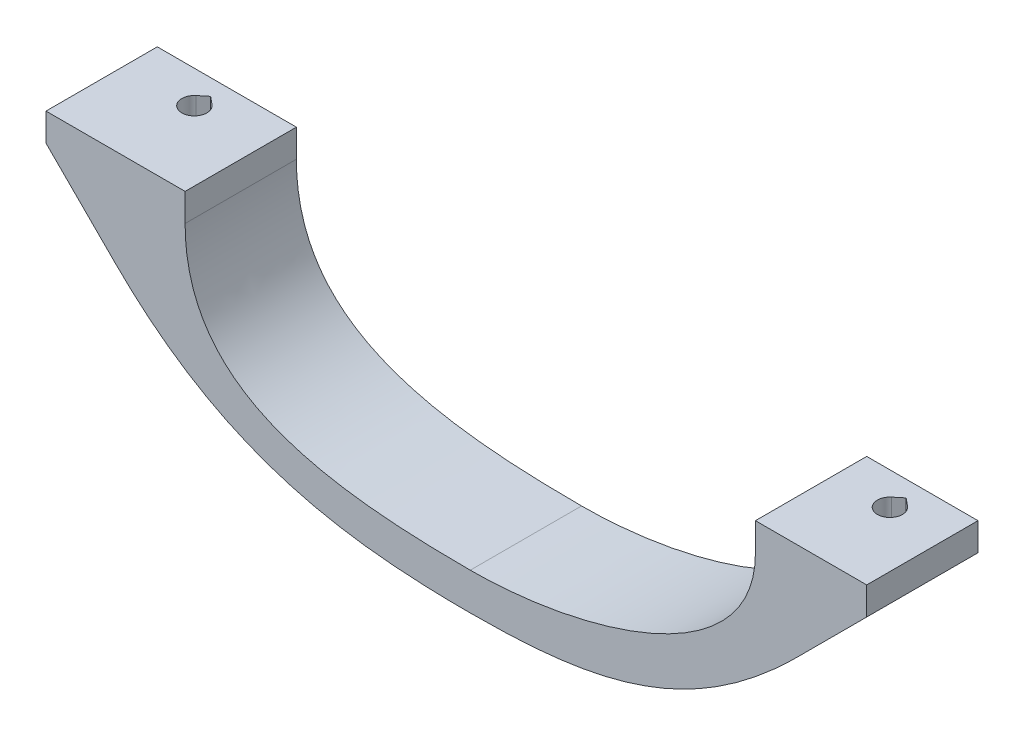
ISO-10303-21;
HEADER;
FILE_DESCRIPTION(('STEP AP214'),'2;1');
FILE_NAME('part.step','',(''),(''),'','','');
FILE_SCHEMA(('AUTOMOTIVE_DESIGN { 1 0 10303 214 1 1 1 1 }'));
ENDSEC;
DATA;
#1=APPLICATION_CONTEXT('core data for automotive mechanical design processes');
#2=APPLICATION_PROTOCOL_DEFINITION('international standard','automotive_design',2000,#1);
#3=PRODUCT_CONTEXT('',#1,'mechanical');
#4=PRODUCT('Part','Part','',(#3));
#5=PRODUCT_RELATED_PRODUCT_CATEGORY('part','',(#4));
#6=PRODUCT_DEFINITION_FORMATION('','',#4);
#7=PRODUCT_DEFINITION_CONTEXT('part definition',#1,'design');
#8=PRODUCT_DEFINITION('design','',#6,#7);
#9=PRODUCT_DEFINITION_SHAPE('','',#8);
#10=(LENGTH_UNIT() NAMED_UNIT(*) SI_UNIT(.MILLI.,.METRE.));
#11=(NAMED_UNIT(*) PLANE_ANGLE_UNIT() SI_UNIT($,.RADIAN.));
#12=(NAMED_UNIT(*) SI_UNIT($,.STERADIAN.) SOLID_ANGLE_UNIT());
#13=UNCERTAINTY_MEASURE_WITH_UNIT(LENGTH_MEASURE(1.E-05),#10,'distance_accuracy_value','');
#14=(GEOMETRIC_REPRESENTATION_CONTEXT(3) GLOBAL_UNCERTAINTY_ASSIGNED_CONTEXT((#13)) GLOBAL_UNIT_ASSIGNED_CONTEXT((#10,
#11,#12)) REPRESENTATION_CONTEXT('',''));
#15=CARTESIAN_POINT('',(0.,0.,0.));
#16=DIRECTION('',(0.,0.,1.));
#17=DIRECTION('',(1.,0.,0.));
#18=AXIS2_PLACEMENT_3D('',#15,#16,#17);
#19=CARTESIAN_POINT('',(82.5,-63.9999999999999,-8.5));
#20=DIRECTION('',(0.,1.,0.));
#21=DIRECTION('',(0.,0.,1.));
#22=AXIS2_PLACEMENT_3D('',#19,#20,#21);
#23=CYLINDRICAL_SURFACE('',#22,1.35000000000001);
#24=DIRECTION('',(0.,1.,0.));
#25=VECTOR('',#24,1.);
#26=CARTESIAN_POINT('',(81.6409734983062,-63.9999999999999,-9.54142857142858));
#27=LINE('',#26,#25);
#28=CARTESIAN_POINT('',(81.6409734983062,-43.,-9.54142857142858));
#29=VERTEX_POINT('',#28);
#30=CARTESIAN_POINT('',(81.6409734983062,-40.,-9.54142857142858));
#31=VERTEX_POINT('',#30);
#32=EDGE_CURVE('E176',#29,#31,#27,.T.);
#33=ORIENTED_EDGE('',*,*,#32,.T.);
#34=CARTESIAN_POINT('',(82.5,-40.,-8.5));
#35=DIRECTION('',(0.,1.,0.));
#36=DIRECTION('',(0.,0.,1.));
#37=AXIS2_PLACEMENT_3D('',#34,#35,#36);
#38=CIRCLE('',#37,1.35000000000001);
#39=CARTESIAN_POINT('',(83.3590265016938,-40.,-9.54142857142858));
#40=VERTEX_POINT('',#39);
#41=EDGE_CURVE('E186',#31,#40,#38,.T.);
#42=ORIENTED_EDGE('',*,*,#41,.T.);
#43=DIRECTION('',(0.,1.,0.));
#44=VECTOR('',#43,1.);
#45=CARTESIAN_POINT('',(83.3590265016938,-63.9999999999999,-9.54142857142858));
#46=LINE('',#45,#44);
#47=CARTESIAN_POINT('',(83.3590265016938,-43.,-9.54142857142858));
#48=VERTEX_POINT('',#47);
#49=EDGE_CURVE('E189',#48,#40,#46,.T.);
#50=ORIENTED_EDGE('',*,*,#49,.F.);
#51=CARTESIAN_POINT('',(82.5,-43.,-8.5));
#52=DIRECTION('',(0.,1.,0.));
#53=DIRECTION('',(0.,0.,1.));
#54=AXIS2_PLACEMENT_3D('',#51,#52,#53);
#55=CIRCLE('',#54,1.35000000000001);
#56=EDGE_CURVE('E188',#48,#29,#55,.F.);
#57=ORIENTED_EDGE('',*,*,#56,.T.);
#58=EDGE_LOOP('',(#33,#42,#50,#57));
#59=FACE_BOUND('',#58,.T.);
#60=ADVANCED_FACE('F37',(#59),#23,.F.);
#61=CARTESIAN_POINT('',(7.5,-63.9999999999999,-8.5));
#62=DIRECTION('',(0.,1.,0.));
#63=DIRECTION('',(0.,0.,1.));
#64=AXIS2_PLACEMENT_3D('',#61,#62,#63);
#65=CYLINDRICAL_SURFACE('',#64,1.35);
#66=DIRECTION('',(0.,1.,0.));
#67=VECTOR('',#66,1.);
#68=CARTESIAN_POINT('',(6.64097349830623,-63.9999999999999,-9.54142857142858));
#69=LINE('',#68,#67);
#70=CARTESIAN_POINT('',(6.64097349830623,-43.,-9.54142857142858));
#71=VERTEX_POINT('',#70);
#72=CARTESIAN_POINT('',(6.64097349830623,-40.,-9.54142857142858));
#73=VERTEX_POINT('',#72);
#74=EDGE_CURVE('E423',#71,#73,#69,.T.);
#75=ORIENTED_EDGE('',*,*,#74,.T.);
#76=CARTESIAN_POINT('',(7.5,-40.,-8.5));
#77=DIRECTION('',(0.,1.,0.));
#78=DIRECTION('',(0.,0.,1.));
#79=AXIS2_PLACEMENT_3D('',#76,#77,#78);
#80=CIRCLE('',#79,1.35);
#81=CARTESIAN_POINT('',(8.35902650169377,-40.,-9.54142857142857));
#82=VERTEX_POINT('',#81);
#83=EDGE_CURVE('E193',#73,#82,#80,.T.);
#84=ORIENTED_EDGE('',*,*,#83,.T.);
#85=DIRECTION('',(0.,1.,0.));
#86=VECTOR('',#85,1.);
#87=CARTESIAN_POINT('',(8.35902650169377,-63.9999999999999,-9.54142857142857));
#88=LINE('',#87,#86);
#89=CARTESIAN_POINT('',(8.35902650169377,-43.,-9.54142857142857));
#90=VERTEX_POINT('',#89);
#91=EDGE_CURVE('E419',#90,#82,#88,.T.);
#92=ORIENTED_EDGE('',*,*,#91,.F.);
#93=CARTESIAN_POINT('',(7.5,-43.,-8.5));
#94=DIRECTION('',(0.,1.,0.));
#95=DIRECTION('',(0.,0.,1.));
#96=AXIS2_PLACEMENT_3D('',#93,#94,#95);
#97=CIRCLE('',#96,1.35);
#98=EDGE_CURVE('E376',#90,#71,#97,.F.);
#99=ORIENTED_EDGE('',*,*,#98,.T.);
#100=EDGE_LOOP('',(#75,#84,#92,#99));
#101=FACE_BOUND('',#100,.T.);
#102=ADVANCED_FACE('F247',(#101),#65,.F.);
#103=CARTESIAN_POINT('',(45.75,-63.9999999999999,-12.));
#104=CARTESIAN_POINT('',(59.0199011969863,-63.9999999999999,-12.));
#105=CARTESIAN_POINT('',(69.4421031795114,-62.0578968204887,-12.));
#106=CARTESIAN_POINT('',(81.,-50.5,-12.));
#107=B_SPLINE_CURVE_WITH_KNOTS('',3,(#103,#104,#105,#106),.UNSPECIFIED.,.F.,.F.,(4,4),(0.,1.),.UNSPECIFIED.);
#108=DIRECTION('',(0.,0.,1.));
#109=VECTOR('',#108,1.);
#110=SURFACE_OF_LINEAR_EXTRUSION('',#107,#109);
#111=DIRECTION('',(0.,0.,1.));
#112=VECTOR('',#111,1.);
#113=CARTESIAN_POINT('',(81.,-50.5,-12.));
#114=LINE('',#113,#112);
#115=CARTESIAN_POINT('',(81.,-50.5,-12.));
#116=VERTEX_POINT('',#115);
#117=CARTESIAN_POINT('',(81.,-50.5,-10.5));
#118=VERTEX_POINT('',#117);
#119=EDGE_CURVE('E351',#116,#118,#114,.T.);
#120=ORIENTED_EDGE('',*,*,#119,.T.);
#121=CARTESIAN_POINT('',(81.,-50.5,-10.5));
#122=CARTESIAN_POINT('',(80.8978799533085,-50.602154744411,-10.4234048646829));
#123=CARTESIAN_POINT('',(80.798532407103,-50.7008050674264,-10.3366462427261));
#124=CARTESIAN_POINT('',(80.6093479466781,-50.8876034704642,-10.1413817827994));
#125=CARTESIAN_POINT('',(80.5196117209184,-50.9756413870717,-10.0326747619081));
#126=CARTESIAN_POINT('',(80.3759505373498,-51.1158846787573,-9.82299975213102));
#127=CARTESIAN_POINT('',(80.3186493345569,-51.1715745989149,-9.72672206239361));
#128=CARTESIAN_POINT('',(80.2158859772383,-51.2711458708271,-9.52263907355065));
#129=CARTESIAN_POINT('',(80.1703878151848,-51.3150631513613,-9.41487028445873));
#130=CARTESIAN_POINT('',(80.1129581158789,-51.370380549298,-9.24542675939085));
#131=CARTESIAN_POINT('',(80.0955476556023,-51.3871269386674,-9.18727996549064));
#132=CARTESIAN_POINT('',(80.0648337523512,-51.4166431510372,-9.06894130926905));
#133=CARTESIAN_POINT('',(80.0515280856971,-51.4294151271193,-9.00875057389531));
#134=CARTESIAN_POINT('',(80.0293300673866,-51.4507101530765,-8.88681823421578));
#135=CARTESIAN_POINT('',(80.0204375290833,-51.4592333826462,-8.825076695615));
#136=CARTESIAN_POINT('',(80.0072810780956,-51.471839632867,-8.70067776034953));
#137=CARTESIAN_POINT('',(80.0030163456924,-51.4759234398688,-8.63802052787412));
#138=CARTESIAN_POINT('',(79.9979295899958,-51.4807954608365,-8.46850397681319));
#139=CARTESIAN_POINT('',(80.0015889132169,-51.4772931858934,-8.36132094712269));
#140=CARTESIAN_POINT('',(80.0223885156301,-51.4573644393085,-8.14959893440992));
#141=CARTESIAN_POINT('',(80.0395264245296,-51.4409402400669,-8.04505948983282));
#142=CARTESIAN_POINT('',(80.0852222355038,-51.3970596661661,-7.84501372893859));
#143=CARTESIAN_POINT('',(80.1133576835453,-51.3700112365557,-7.74931907675146));
#144=CARTESIAN_POINT('',(80.1794315384967,-51.3063281124676,-7.56480824031657));
#145=CARTESIAN_POINT('',(80.2173730599392,-51.2696903722569,-7.47599425312471));
#146=CARTESIAN_POINT('',(80.3184245823851,-51.1718098872717,-7.27181373568218));
#147=CARTESIAN_POINT('',(80.3854994327815,-51.1066162044042,-7.16030196521182));
#148=CARTESIAN_POINT('',(80.531411219059,-50.9640524550705,-6.95380446864902));
#149=CARTESIAN_POINT('',(80.6102775690707,-50.8866519110895,-6.85886139500016));
#150=CARTESIAN_POINT('',(80.7420191900938,-50.7566227977047,-6.72109637914178));
#151=CARTESIAN_POINT('',(80.7922597065752,-50.7068824274382,-6.67288713108134));
#152=CARTESIAN_POINT('',(80.8947149797709,-50.6051059543629,-6.58226793205849));
#153=CARTESIAN_POINT('',(80.9469155033842,-50.553086066152,-6.53982375540152));
#154=CARTESIAN_POINT('',(81.,-50.5,-6.50000000000001));
#155=B_SPLINE_CURVE_WITH_KNOTS('',3,(#121,#122,#123,#124,#125,#126,#127,#128,#129,#130,#131,
#132,#133,#134,#135,#136,#137,#138,#139,#140,#141,#142,#143,#144,#145,#146,#147,#148,#149,#150,
#151,#152,#153,#154),.UNSPECIFIED.,.F.,.F.,(4,2,2,2,2,2,2,2,2,2,2,2,2,2,2,2,4),(0.,
0.491474026861417,0.98767612511601,1.36164356955517,1.7344563667553,1.9231061864695,
2.11165362919935,2.30019309691203,2.48869916336274,2.8087933147325,3.12883118814948,
3.43762310188214,3.74651321260427,4.18078117785821,4.61615108771081,4.87264109239589,
5.12753478184145),.UNSPECIFIED.);
#156=CARTESIAN_POINT('',(81.,-50.5,-6.50000000000001));
#157=VERTEX_POINT('',#156);
#158=EDGE_CURVE('E382',#118,#157,#155,.T.);
#159=ORIENTED_EDGE('',*,*,#158,.T.);
#160=CARTESIAN_POINT('',(81.,-50.5,0.));
#161=VERTEX_POINT('',#160);
#162=EDGE_CURVE('E354',#157,#161,#114,.T.);
#163=ORIENTED_EDGE('',*,*,#162,.T.);
#164=CARTESIAN_POINT('',(45.75,-63.9999999999999,0.));
#165=CARTESIAN_POINT('',(59.0199011969863,-63.9999999999999,0.));
#166=CARTESIAN_POINT('',(69.4421031795114,-62.0578968204887,0.));
#167=CARTESIAN_POINT('',(81.,-50.5,0.));
#168=B_SPLINE_CURVE_WITH_KNOTS('',3,(#164,#165,#166,#167),.UNSPECIFIED.,.F.,.F.,(4,4),(0.,1.),.UNSPECIFIED.);
#169=CARTESIAN_POINT('',(45.75,-63.9999999999999,0.));
#170=VERTEX_POINT('',#169);
#171=EDGE_CURVE('E335',#170,#161,#168,.T.);
#172=ORIENTED_EDGE('',*,*,#171,.F.);
#173=DIRECTION('',(0.,0.,1.));
#174=VECTOR('',#173,1.);
#175=CARTESIAN_POINT('',(45.75,-63.9999999999999,-12.));
#176=LINE('',#175,#174);
#177=CARTESIAN_POINT('',(45.75,-63.9999999999999,-12.));
#178=VERTEX_POINT('',#177);
#179=EDGE_CURVE('E355',#178,#170,#176,.T.);
#180=ORIENTED_EDGE('',*,*,#179,.F.);
#181=EDGE_CURVE('E276',#178,#116,#107,.T.);
#182=ORIENTED_EDGE('',*,*,#181,.T.);
#183=EDGE_LOOP('',(#120,#159,#163,#172,#180,#182));
#184=FACE_BOUND('',#183,.T.);
#185=ADVANCED_FACE('F252',(#184),#110,.T.);
#186=CARTESIAN_POINT('',(7.5,-50.4999999999999,-12.));
#187=CARTESIAN_POINT('',(19.0731812469173,-62.073181246917,-12.));
#188=CARTESIAN_POINT('',(31.7289344991981,-63.9999999999999,-12.));
#189=CARTESIAN_POINT('',(45.75,-63.9999999999999,-12.));
#190=B_SPLINE_CURVE_WITH_KNOTS('',3,(#186,#187,#188,#189),.UNSPECIFIED.,.F.,.F.,(4,4),(0.,1.),.UNSPECIFIED.);
#191=DIRECTION('',(0.,0.,1.));
#192=VECTOR('',#191,1.);
#193=SURFACE_OF_LINEAR_EXTRUSION('',#190,#192);
#194=DIRECTION('',(0.,0.,1.));
#195=VECTOR('',#194,1.);
#196=CARTESIAN_POINT('',(7.5,-50.4999999999999,-12.));
#197=LINE('',#196,#195);
#198=CARTESIAN_POINT('',(7.5,-50.4999999999999,-6.));
#199=VERTEX_POINT('',#198);
#200=CARTESIAN_POINT('',(7.5,-50.4999999999999,0.));
#201=VERTEX_POINT('',#200);
#202=EDGE_CURVE('E360',#199,#201,#197,.T.);
#203=ORIENTED_EDGE('',*,*,#202,.F.);
#204=CARTESIAN_POINT('',(7.5,-50.4999999999999,-6.));
#205=CARTESIAN_POINT('',(7.59202458361,-50.5920313219231,-6.00002218462616));
#206=CARTESIAN_POINT('',(7.68441911287658,-50.6837408818792,-6.00508367174386));
#207=CARTESIAN_POINT('',(7.86944957853199,-50.8660458805666,-6.02568805679928));
#208=CARTESIAN_POINT('',(7.96208565508688,-50.9566391004135,-6.04124919643966));
#209=CARTESIAN_POINT('',(8.14770775603045,-51.1368207073336,-6.08347037070071));
#210=CARTESIAN_POINT('',(8.24068787286012,-51.22638971867,-6.11024086164087));
#211=CARTESIAN_POINT('',(8.42508927550051,-51.4027117137785,-6.17539953246386));
#212=CARTESIAN_POINT('',(8.51651175271218,-51.4894669003341,-6.21377836927347));
#213=CARTESIAN_POINT('',(8.73076418009163,-51.6913056075003,-6.31954656331152));
#214=CARTESIAN_POINT('',(8.85248238259892,-51.8047794211707,-6.39241801336778));
#215=CARTESIAN_POINT('',(9.08694581756101,-52.0213194616817,-6.56286168266068));
#216=CARTESIAN_POINT('',(9.19972211828598,-52.1244220916136,-6.6603429651215));
#217=CARTESIAN_POINT('',(9.38819086542387,-52.2953049074502,-6.85712963054419));
#218=CARTESIAN_POINT('',(9.46660176235044,-52.3658805543693,-6.95138182618938));
#219=CARTESIAN_POINT('',(9.61152992564585,-52.4955981526102,-7.15572308259922));
#220=CARTESIAN_POINT('',(9.67805697565096,-52.554749512514,-7.26579898014069));
#221=CARTESIAN_POINT('',(9.78504966032763,-52.6494706197074,-7.48005055612949));
#222=CARTESIAN_POINT('',(9.82803412395988,-52.6873509694142,-7.58193869411243));
#223=CARTESIAN_POINT('',(9.90080718606569,-52.751320384317,-7.79385076122565));
#224=CARTESIAN_POINT('',(9.93060331096411,-52.7774161749906,-7.90387000808403));
#225=CARTESIAN_POINT('',(9.97513744033179,-52.8163707843204,-8.12984435449814));
#226=CARTESIAN_POINT('',(9.98979733423343,-52.8291609417525,-8.24582703409824));
#227=CARTESIAN_POINT('',(10.002646316179,-52.8403730329712,-8.47938867719886));
#228=CARTESIAN_POINT('',(10.0008401428213,-52.8387991004497,-8.59696717173118));
#229=CARTESIAN_POINT('',(9.98179574857887,-52.8221756698972,-8.81949198828808));
#230=CARTESIAN_POINT('',(9.96591048249544,-52.8083075739352,-8.92464899489288));
#231=CARTESIAN_POINT('',(9.92156955276857,-52.769502732464,-9.13012060341624));
#232=CARTESIAN_POINT('',(9.89311302477881,-52.7445652258687,-9.23043487184261));
#233=CARTESIAN_POINT('',(9.82393993327737,-52.6837422260228,-9.42770453956132));
#234=CARTESIAN_POINT('',(9.78280799786503,-52.6474851624174,-9.52439757850328));
#235=CARTESIAN_POINT('',(9.69073215488594,-52.5659718056744,-9.70885980114546));
#236=CARTESIAN_POINT('',(9.63978297498199,-52.5207106764907,-9.79662415083185));
#237=CARTESIAN_POINT('',(9.50549519568935,-52.4008187949479,-9.99955725921369));
#238=CARTESIAN_POINT('',(9.41784972250229,-52.3220958931799,-10.1094742949846));
#239=CARTESIAN_POINT('',(9.23117583801767,-52.1530228059143,-10.3088019881589));
#240=CARTESIAN_POINT('',(9.13212444586179,-52.0626491007917,-10.3981701186301));
#241=CARTESIAN_POINT('',(8.89187877865116,-51.8414850017041,-10.5839559155556));
#242=CARTESIAN_POINT('',(8.74774593650178,-51.7073498402054,-10.6725687225006));
#243=CARTESIAN_POINT('',(8.45268853763737,-51.4292929085556,-10.81720725006));
#244=CARTESIAN_POINT('',(8.3017530244732,-51.2853551447969,-10.8731782183824));
#245=CARTESIAN_POINT('',(8.04151415317255,-51.0340415507112,-10.9432198151391));
#246=CARTESIAN_POINT('',(7.93274587827513,-50.9280807424228,-10.9647165524253));
#247=CARTESIAN_POINT('',(7.7158191966663,-50.7148904687216,-10.993041458396));
#248=CARTESIAN_POINT('',(7.60766105011408,-50.607672443387,-10.9999569414402));
#249=CARTESIAN_POINT('',(7.5,-50.4999999999999,-11.));
#250=B_SPLINE_CURVE_WITH_KNOTS('',3,(#204,#205,#206,#207,#208,#209,#210,#211,#212,#213,#214,
#215,#216,#217,#218,#219,#220,#221,#222,#223,#224,#225,#226,#227,#228,#229,#230,#231,#232,#233,
#234,#235,#236,#237,#238,#239,#240,#241,#242,#243,#244,#245,#246,#247,#248,#249),.UNSPECIFIED.,
.F.,.F.,(4,2,2,2,2,2,2,2,2,2,2,2,2,2,2,2,2,2,2,2,2,2,4),(0.,0.390393734827483,0.781467477503611,
1.17648906592481,1.57119356017286,2.11426479469428,2.65535794863998,3.078214385065,
3.50072107495811,3.84995299924723,4.19898536333423,4.54981004151233,4.90053376269015,
5.22081811891119,5.54112449994628,5.87330454117322,6.20566347895937,6.68636128150267,
7.16804513224342,7.81233786743228,8.45770823154506,8.91712723193044,9.3737872688862),.UNSPECIFIED.);
#251=CARTESIAN_POINT('',(7.5,-50.4999999999999,-11.));
#252=VERTEX_POINT('',#251);
#253=EDGE_CURVE('E200',#199,#252,#250,.T.);
#254=ORIENTED_EDGE('',*,*,#253,.T.);
#255=CARTESIAN_POINT('',(7.5,-50.4999999999999,-12.));
#256=VERTEX_POINT('',#255);
#257=EDGE_CURVE('E357',#256,#252,#197,.T.);
#258=ORIENTED_EDGE('',*,*,#257,.F.);
#259=EDGE_CURVE('E283',#256,#178,#190,.T.);
#260=ORIENTED_EDGE('',*,*,#259,.T.);
#261=ORIENTED_EDGE('',*,*,#179,.T.);
#262=CARTESIAN_POINT('',(7.5,-50.4999999999999,0.));
#263=CARTESIAN_POINT('',(19.0731812469173,-62.073181246917,0.));
#264=CARTESIAN_POINT('',(31.7289344991981,-63.9999999999999,0.));
#265=CARTESIAN_POINT('',(45.75,-63.9999999999999,0.));
#266=B_SPLINE_CURVE_WITH_KNOTS('',3,(#262,#263,#264,#265),.UNSPECIFIED.,.F.,.F.,(4,4),(0.,1.),.UNSPECIFIED.);
#267=EDGE_CURVE('E330',#201,#170,#266,.T.);
#268=ORIENTED_EDGE('',*,*,#267,.F.);
#269=EDGE_LOOP('',(#203,#254,#258,#260,#261,#268));
#270=FACE_BOUND('',#269,.T.);
#271=ADVANCED_FACE('F270',(#270),#193,.T.);
#272=CARTESIAN_POINT('',(88.5,-40.,-12.));
#273=DIRECTION('',(1.,0.,0.));
#274=DIRECTION('',(0.,0.,-1.));
#275=AXIS2_PLACEMENT_3D('',#272,#273,#274);
#276=PLANE('',#275);
#277=DIRECTION('',(0.,1.,0.));
#278=VECTOR('',#277,1.);
#279=CARTESIAN_POINT('',(88.5,-40.,0.));
#280=LINE('',#279,#278);
#281=CARTESIAN_POINT('',(88.5,-43.,0.));
#282=VERTEX_POINT('',#281);
#283=CARTESIAN_POINT('',(88.5,-40.,0.));
#284=VERTEX_POINT('',#283);
#285=EDGE_CURVE('E197',#282,#284,#280,.T.);
#286=ORIENTED_EDGE('',*,*,#285,.F.);
#287=DIRECTION('',(0.,0.,1.));
#288=VECTOR('',#287,1.);
#289=CARTESIAN_POINT('',(88.5,-43.,-12.));
#290=LINE('',#289,#288);
#291=CARTESIAN_POINT('',(88.5,-43.,-12.));
#292=VERTEX_POINT('',#291);
#293=EDGE_CURVE('E348',#292,#282,#290,.T.);
#294=ORIENTED_EDGE('',*,*,#293,.F.);
#295=DIRECTION('',(0.,1.,0.));
#296=VECTOR('',#295,1.);
#297=CARTESIAN_POINT('',(88.5,-40.,-12.));
#298=LINE('',#297,#296);
#299=CARTESIAN_POINT('',(88.5,-40.,-12.));
#300=VERTEX_POINT('',#299);
#301=EDGE_CURVE('E203',#292,#300,#298,.T.);
#302=ORIENTED_EDGE('',*,*,#301,.T.);
#303=DIRECTION('',(0.,0.,1.));
#304=VECTOR('',#303,1.);
#305=CARTESIAN_POINT('',(88.5,-40.,-12.));
#306=LINE('',#305,#304);
#307=EDGE_CURVE('E293',#300,#284,#306,.T.);
#308=ORIENTED_EDGE('',*,*,#307,.T.);
#309=EDGE_LOOP('',(#286,#294,#302,#308));
#310=FACE_BOUND('',#309,.T.);
#311=ADVANCED_FACE('F39',(#310),#276,.T.);
#312=CARTESIAN_POINT('',(88.5,-43.,-12.));
#313=DIRECTION('',(0.70710678118655,-0.707106781186546,0.));
#314=DIRECTION('',(0.707106781186546,0.70710678118655,0.));
#315=AXIS2_PLACEMENT_3D('',#312,#313,#314);
#316=PLANE('',#315);
#317=ORIENTED_EDGE('',*,*,#162,.F.);
#318=CARTESIAN_POINT('',(82.5,-49.,-8.5));
#319=DIRECTION('',(0.70710678118655,-0.707106781186546,0.));
#320=DIRECTION('',(-0.707106781186546,-0.70710678118655,0.));
#321=AXIS2_PLACEMENT_3D('',#318,#319,#320);
#322=ELLIPSE('',#321,3.53553390593274,2.5);
#323=EDGE_CURVE('E194',#157,#118,#322,.F.);
#324=ORIENTED_EDGE('',*,*,#323,.T.);
#325=ORIENTED_EDGE('',*,*,#119,.F.);
#326=DIRECTION('',(0.707106781186545,0.707106781186549,0.));
#327=VECTOR('',#326,1.);
#328=CARTESIAN_POINT('',(88.5,-43.,-12.));
#329=LINE('',#328,#327);
#330=EDGE_CURVE('E282',#116,#292,#329,.T.);
#331=ORIENTED_EDGE('',*,*,#330,.T.);
#332=ORIENTED_EDGE('',*,*,#293,.T.);
#333=DIRECTION('',(0.707106781186545,0.707106781186549,0.));
#334=VECTOR('',#333,1.);
#335=CARTESIAN_POINT('',(88.5,-43.,0.));
#336=LINE('',#335,#334);
#337=EDGE_CURVE('E207',#161,#282,#336,.T.);
#338=ORIENTED_EDGE('',*,*,#337,.F.);
#339=EDGE_LOOP('',(#317,#324,#325,#331,#332,#338));
#340=FACE_BOUND('',#339,.T.);
#341=ADVANCED_FACE('F261',(#340),#316,.T.);
#342=CARTESIAN_POINT('',(0.,-43.,-12.));
#343=DIRECTION('',(-0.707106781186544,-0.707106781186551,0.));
#344=DIRECTION('',(0.707106781186551,-0.707106781186544,0.));
#345=AXIS2_PLACEMENT_3D('',#342,#343,#344);
#346=PLANE('',#345);
#347=ORIENTED_EDGE('',*,*,#257,.T.);
#348=CARTESIAN_POINT('',(7.5,-50.4999999999999,-8.5));
#349=DIRECTION('',(-0.707106781186544,-0.707106781186551,0.));
#350=DIRECTION('',(0.707106781186551,-0.707106781186544,0.));
#351=AXIS2_PLACEMENT_3D('',#348,#349,#350);
#352=ELLIPSE('',#351,3.53553390593272,2.5);
#353=EDGE_CURVE('E350',#252,#199,#352,.F.);
#354=ORIENTED_EDGE('',*,*,#353,.T.);
#355=ORIENTED_EDGE('',*,*,#202,.T.);
#356=DIRECTION('',(0.707106781186551,-0.707106781186544,0.));
#357=VECTOR('',#356,1.);
#358=CARTESIAN_POINT('',(0.,-43.,0.));
#359=LINE('',#358,#357);
#360=CARTESIAN_POINT('',(0.,-43.,0.));
#361=VERTEX_POINT('',#360);
#362=EDGE_CURVE('E327',#361,#201,#359,.T.);
#363=ORIENTED_EDGE('',*,*,#362,.F.);
#364=DIRECTION('',(0.,0.,1.));
#365=VECTOR('',#364,1.);
#366=CARTESIAN_POINT('',(0.,-43.,-12.));
#367=LINE('',#366,#365);
#368=CARTESIAN_POINT('',(0.,-43.,-12.));
#369=VERTEX_POINT('',#368);
#370=EDGE_CURVE('E361',#369,#361,#367,.T.);
#371=ORIENTED_EDGE('',*,*,#370,.F.);
#372=DIRECTION('',(0.707106781186551,-0.707106781186544,0.));
#373=VECTOR('',#372,1.);
#374=CARTESIAN_POINT('',(0.,-43.,-12.));
#375=LINE('',#374,#373);
#376=EDGE_CURVE('E481',#369,#256,#375,.T.);
#377=ORIENTED_EDGE('',*,*,#376,.T.);
#378=EDGE_LOOP('',(#347,#354,#355,#363,#371,#377));
#379=FACE_BOUND('',#378,.T.);
#380=ADVANCED_FACE('F264',(#379),#346,.T.);
#381=CARTESIAN_POINT('',(0.,-40.,-12.));
#382=DIRECTION('',(-1.,0.,0.));
#383=DIRECTION('',(0.,-1.,0.));
#384=AXIS2_PLACEMENT_3D('',#381,#382,#383);
#385=PLANE('',#384);
#386=DIRECTION('',(0.,-1.,0.));
#387=VECTOR('',#386,1.);
#388=CARTESIAN_POINT('',(0.,-40.,0.));
#389=LINE('',#388,#387);
#390=CARTESIAN_POINT('',(0.,-40.,0.));
#391=VERTEX_POINT('',#390);
#392=EDGE_CURVE('E324',#391,#361,#389,.T.);
#393=ORIENTED_EDGE('',*,*,#392,.F.);
#394=DIRECTION('',(0.,0.,1.));
#395=VECTOR('',#394,1.);
#396=CARTESIAN_POINT('',(0.,-40.,-12.));
#397=LINE('',#396,#395);
#398=CARTESIAN_POINT('',(0.,-40.,-12.));
#399=VERTEX_POINT('',#398);
#400=EDGE_CURVE('E363',#399,#391,#397,.T.);
#401=ORIENTED_EDGE('',*,*,#400,.F.);
#402=DIRECTION('',(0.,-1.,0.));
#403=VECTOR('',#402,1.);
#404=CARTESIAN_POINT('',(0.,-40.,-12.));
#405=LINE('',#404,#403);
#406=EDGE_CURVE('E477',#399,#369,#405,.T.);
#407=ORIENTED_EDGE('',*,*,#406,.T.);
#408=ORIENTED_EDGE('',*,*,#370,.T.);
#409=EDGE_LOOP('',(#393,#401,#407,#408));
#410=FACE_BOUND('',#409,.T.);
#411=ADVANCED_FACE('F462',(#410),#385,.T.);
#412=CARTESIAN_POINT('',(15.,-40.,-12.));
#413=DIRECTION('',(0.,1.,0.));
#414=DIRECTION('',(0.,0.,1.));
#415=AXIS2_PLACEMENT_3D('',#412,#413,#414);
#416=PLANE('',#415);
#417=DIRECTION('',(-0.771428571428573,0.,0.636315927180573));
#418=VECTOR('',#417,1.);
#419=CARTESIAN_POINT('',(7.5,-40.,-10.25));
#420=LINE('',#419,#418);
#421=CARTESIAN_POINT('',(7.5,-40.,-10.25));
#422=VERTEX_POINT('',#421);
#423=EDGE_CURVE('E452',#422,#73,#420,.T.);
#424=ORIENTED_EDGE('',*,*,#423,.F.);
#425=DIRECTION('',(-0.771428571428571,0.,-0.636315927180574));
#426=VECTOR('',#425,1.);
#427=CARTESIAN_POINT('',(7.5,-40.,-10.25));
#428=LINE('',#427,#426);
#429=EDGE_CURVE('E426',#82,#422,#428,.T.);
#430=ORIENTED_EDGE('',*,*,#429,.F.);
#431=ORIENTED_EDGE('',*,*,#83,.F.);
#432=EDGE_LOOP('',(#424,#430,#431));
#433=FACE_BOUND('',#432,.T.);
#434=DIRECTION('',(-1.,0.,0.));
#435=VECTOR('',#434,1.);
#436=CARTESIAN_POINT('',(15.,-40.,0.));
#437=LINE('',#436,#435);
#438=CARTESIAN_POINT('',(15.,-40.,0.));
#439=VERTEX_POINT('',#438);
#440=EDGE_CURVE('E321',#439,#391,#437,.T.);
#441=ORIENTED_EDGE('',*,*,#440,.F.);
#442=DIRECTION('',(0.,0.,1.));
#443=VECTOR('',#442,1.);
#444=CARTESIAN_POINT('',(15.,-40.,-12.));
#445=LINE('',#444,#443);
#446=CARTESIAN_POINT('',(15.,-40.,-12.));
#447=VERTEX_POINT('',#446);
#448=EDGE_CURVE('E365',#447,#439,#445,.T.);
#449=ORIENTED_EDGE('',*,*,#448,.F.);
#450=DIRECTION('',(-1.,0.,0.));
#451=VECTOR('',#450,1.);
#452=CARTESIAN_POINT('',(15.,-40.,-12.));
#453=LINE('',#452,#451);
#454=EDGE_CURVE('E476',#447,#399,#453,.T.);
#455=ORIENTED_EDGE('',*,*,#454,.T.);
#456=ORIENTED_EDGE('',*,*,#400,.T.);
#457=EDGE_LOOP('',(#441,#449,#455,#456));
#458=FACE_BOUND('',#457,.T.);
#459=ADVANCED_FACE('F458',(#433,#458),#416,.T.);
#460=CARTESIAN_POINT('',(15.,-40.,-12.));
#461=DIRECTION('',(1.,0.,0.));
#462=DIRECTION('',(0.,0.,-1.));
#463=AXIS2_PLACEMENT_3D('',#460,#461,#462);
#464=PLANE('',#463);
#465=DIRECTION('',(0.,1.,0.));
#466=VECTOR('',#465,1.);
#467=CARTESIAN_POINT('',(15.,-40.,0.));
#468=LINE('',#467,#466);
#469=CARTESIAN_POINT('',(15.,-43.,0.));
#470=VERTEX_POINT('',#469);
#471=EDGE_CURVE('E315',#470,#439,#468,.T.);
#472=ORIENTED_EDGE('',*,*,#471,.F.);
#473=DIRECTION('',(0.,0.,1.));
#474=VECTOR('',#473,1.);
#475=CARTESIAN_POINT('',(15.,-43.,-12.));
#476=LINE('',#475,#474);
#477=CARTESIAN_POINT('',(15.,-43.,-12.));
#478=VERTEX_POINT('',#477);
#479=EDGE_CURVE('E367',#478,#470,#476,.T.);
#480=ORIENTED_EDGE('',*,*,#479,.F.);
#481=DIRECTION('',(0.,1.,0.));
#482=VECTOR('',#481,1.);
#483=CARTESIAN_POINT('',(15.,-40.,-12.));
#484=LINE('',#483,#482);
#485=EDGE_CURVE('E473',#478,#447,#484,.T.);
#486=ORIENTED_EDGE('',*,*,#485,.T.);
#487=ORIENTED_EDGE('',*,*,#448,.T.);
#488=EDGE_LOOP('',(#472,#480,#486,#487));
#489=FACE_BOUND('',#488,.T.);
#490=ADVANCED_FACE('F461',(#489),#464,.T.);
#491=CARTESIAN_POINT('',(45.7500000000001,-60.,-12.));
#492=CARTESIAN_POINT('',(29.6680228867207,-60.,-12.));
#493=CARTESIAN_POINT('',(15.,-57.8895101463763,-12.));
#494=CARTESIAN_POINT('',(15.,-43.,-12.));
#495=B_SPLINE_CURVE_WITH_KNOTS('',3,(#491,#492,#493,#494),.UNSPECIFIED.,.F.,.F.,(4,4),(0.,1.),.UNSPECIFIED.);
#496=DIRECTION('',(0.,0.,1.));
#497=VECTOR('',#496,1.);
#498=SURFACE_OF_LINEAR_EXTRUSION('',#495,#497);
#499=CARTESIAN_POINT('',(45.7500000000001,-60.,0.));
#500=CARTESIAN_POINT('',(29.6680228867207,-60.,0.));
#501=CARTESIAN_POINT('',(15.,-57.8895101463763,0.));
#502=CARTESIAN_POINT('',(15.,-43.,0.));
#503=B_SPLINE_CURVE_WITH_KNOTS('',3,(#499,#500,#501,#502),.UNSPECIFIED.,.F.,.F.,(4,4),(0.,1.),.UNSPECIFIED.);
#504=CARTESIAN_POINT('',(45.75,-60.,0.));
#505=VERTEX_POINT('',#504);
#506=EDGE_CURVE('E307',#505,#470,#503,.T.);
#507=ORIENTED_EDGE('',*,*,#506,.F.);
#508=DIRECTION('',(0.,0.,1.));
#509=VECTOR('',#508,1.);
#510=CARTESIAN_POINT('',(45.75,-60.,-12.));
#511=LINE('',#510,#509);
#512=CARTESIAN_POINT('',(45.75,-60.,-12.));
#513=VERTEX_POINT('',#512);
#514=EDGE_CURVE('E369',#513,#505,#511,.T.);
#515=ORIENTED_EDGE('',*,*,#514,.F.);
#516=EDGE_CURVE('E219',#513,#478,#495,.T.);
#517=ORIENTED_EDGE('',*,*,#516,.T.);
#518=ORIENTED_EDGE('',*,*,#479,.T.);
#519=EDGE_LOOP('',(#507,#515,#517,#518));
#520=FACE_BOUND('',#519,.T.);
#521=ADVANCED_FACE('F233',(#520),#498,.T.);
#522=CARTESIAN_POINT('',(76.5,-43.,-12.));
#523=CARTESIAN_POINT('',(76.5,-54.661574252392,-12.));
#524=CARTESIAN_POINT('',(58.3531852234972,-60.,-12.));
#525=CARTESIAN_POINT('',(45.75,-60.,-12.));
#526=B_SPLINE_CURVE_WITH_KNOTS('',3,(#522,#523,#524,#525),.UNSPECIFIED.,.F.,.F.,(4,4),(0.,1.),.UNSPECIFIED.);
#527=DIRECTION('',(0.,0.,1.));
#528=VECTOR('',#527,1.);
#529=SURFACE_OF_LINEAR_EXTRUSION('',#526,#528);
#530=CARTESIAN_POINT('',(76.5,-43.,0.));
#531=CARTESIAN_POINT('',(76.5,-54.661574252392,0.));
#532=CARTESIAN_POINT('',(58.3531852234972,-60.,0.));
#533=CARTESIAN_POINT('',(45.75,-60.,0.));
#534=B_SPLINE_CURVE_WITH_KNOTS('',3,(#530,#531,#532,#533),.UNSPECIFIED.,.F.,.F.,(4,4),(0.,1.),.UNSPECIFIED.);
#535=CARTESIAN_POINT('',(76.5,-43.,0.));
#536=VERTEX_POINT('',#535);
#537=EDGE_CURVE('E302',#536,#505,#534,.T.);
#538=ORIENTED_EDGE('',*,*,#537,.F.);
#539=DIRECTION('',(0.,0.,1.));
#540=VECTOR('',#539,1.);
#541=CARTESIAN_POINT('',(76.5,-43.,-12.));
#542=LINE('',#541,#540);
#543=CARTESIAN_POINT('',(76.5,-43.,-12.));
#544=VERTEX_POINT('',#543);
#545=EDGE_CURVE('E371',#544,#536,#542,.T.);
#546=ORIENTED_EDGE('',*,*,#545,.F.);
#547=EDGE_CURVE('E213',#544,#513,#526,.T.);
#548=ORIENTED_EDGE('',*,*,#547,.T.);
#549=ORIENTED_EDGE('',*,*,#514,.T.);
#550=EDGE_LOOP('',(#538,#546,#548,#549));
#551=FACE_BOUND('',#550,.T.);
#552=ADVANCED_FACE('F228',(#551),#529,.T.);
#553=CARTESIAN_POINT('',(76.5,-40.,-12.));
#554=DIRECTION('',(-1.,0.,0.));
#555=DIRECTION('',(0.,0.,1.));
#556=AXIS2_PLACEMENT_3D('',#553,#554,#555);
#557=PLANE('',#556);
#558=DIRECTION('',(0.,-1.,0.));
#559=VECTOR('',#558,1.);
#560=CARTESIAN_POINT('',(76.5,-40.,0.));
#561=LINE('',#560,#559);
#562=CARTESIAN_POINT('',(76.5,-40.,0.));
#563=VERTEX_POINT('',#562);
#564=EDGE_CURVE('E299',#563,#536,#561,.T.);
#565=ORIENTED_EDGE('',*,*,#564,.F.);
#566=DIRECTION('',(0.,0.,1.));
#567=VECTOR('',#566,1.);
#568=CARTESIAN_POINT('',(76.5,-40.,-12.));
#569=LINE('',#568,#567);
#570=CARTESIAN_POINT('',(76.5,-40.,-12.));
#571=VERTEX_POINT('',#570);
#572=EDGE_CURVE('E373',#571,#563,#569,.T.);
#573=ORIENTED_EDGE('',*,*,#572,.F.);
#574=DIRECTION('',(0.,-1.,0.));
#575=VECTOR('',#574,1.);
#576=CARTESIAN_POINT('',(76.5,-40.,-12.));
#577=LINE('',#576,#575);
#578=EDGE_CURVE('E210',#571,#544,#577,.T.);
#579=ORIENTED_EDGE('',*,*,#578,.T.);
#580=ORIENTED_EDGE('',*,*,#545,.T.);
#581=EDGE_LOOP('',(#565,#573,#579,#580));
#582=FACE_BOUND('',#581,.T.);
#583=ADVANCED_FACE('F232',(#582),#557,.T.);
#584=CARTESIAN_POINT('',(88.5,-40.,-12.));
#585=DIRECTION('',(0.,1.,0.));
#586=DIRECTION('',(0.,0.,1.));
#587=AXIS2_PLACEMENT_3D('',#584,#585,#586);
#588=PLANE('',#587);
#589=DIRECTION('',(-0.771428571428577,0.,0.636315927180567));
#590=VECTOR('',#589,1.);
#591=CARTESIAN_POINT('',(82.5,-40.,-10.25));
#592=LINE('',#591,#590);
#593=CARTESIAN_POINT('',(82.5,-40.,-10.25));
#594=VERTEX_POINT('',#593);
#595=EDGE_CURVE('E173',#594,#31,#592,.T.);
#596=ORIENTED_EDGE('',*,*,#595,.F.);
#597=DIRECTION('',(-0.771428571428577,0.,-0.636315927180567));
#598=VECTOR('',#597,1.);
#599=CARTESIAN_POINT('',(82.5,-40.,-10.25));
#600=LINE('',#599,#598);
#601=EDGE_CURVE('E180',#40,#594,#600,.T.);
#602=ORIENTED_EDGE('',*,*,#601,.F.);
#603=ORIENTED_EDGE('',*,*,#41,.F.);
#604=EDGE_LOOP('',(#596,#602,#603));
#605=FACE_BOUND('',#604,.T.);
#606=DIRECTION('',(-1.,0.,0.));
#607=VECTOR('',#606,1.);
#608=CARTESIAN_POINT('',(88.5,-40.,0.));
#609=LINE('',#608,#607);
#610=EDGE_CURVE('E296',#284,#563,#609,.T.);
#611=ORIENTED_EDGE('',*,*,#610,.F.);
#612=ORIENTED_EDGE('',*,*,#307,.F.);
#613=DIRECTION('',(-1.,0.,0.));
#614=VECTOR('',#613,1.);
#615=CARTESIAN_POINT('',(88.5,-40.,-12.));
#616=LINE('',#615,#614);
#617=EDGE_CURVE('E206',#300,#571,#616,.T.);
#618=ORIENTED_EDGE('',*,*,#617,.T.);
#619=ORIENTED_EDGE('',*,*,#572,.T.);
#620=EDGE_LOOP('',(#611,#612,#618,#619));
#621=FACE_BOUND('',#620,.T.);
#622=ADVANCED_FACE('F191',(#605,#621),#588,.T.);
#623=CARTESIAN_POINT('',(64.0170016411866,-61.5842113076832,-12.));
#624=DIRECTION('',(0.,0.,1.));
#625=DIRECTION('',(1.,0.,0.));
#626=AXIS2_PLACEMENT_3D('',#623,#624,#625);
#627=PLANE('',#626);
#628=ORIENTED_EDGE('',*,*,#301,.F.);
#629=ORIENTED_EDGE('',*,*,#330,.F.);
#630=ORIENTED_EDGE('',*,*,#181,.F.);
#631=ORIENTED_EDGE('',*,*,#259,.F.);
#632=ORIENTED_EDGE('',*,*,#376,.F.);
#633=ORIENTED_EDGE('',*,*,#406,.F.);
#634=ORIENTED_EDGE('',*,*,#454,.F.);
#635=ORIENTED_EDGE('',*,*,#485,.F.);
#636=ORIENTED_EDGE('',*,*,#516,.F.);
#637=ORIENTED_EDGE('',*,*,#547,.F.);
#638=ORIENTED_EDGE('',*,*,#578,.F.);
#639=ORIENTED_EDGE('',*,*,#617,.F.);
#640=EDGE_LOOP('',(#628,#629,#630,#631,#632,#633,#634,#635,#636,#637,#638,#639));
#641=FACE_BOUND('',#640,.T.);
#642=ADVANCED_FACE('F239',(#641),#627,.F.);
#643=CARTESIAN_POINT('',(64.0170016411866,-61.5842113076832,0.));
#644=DIRECTION('',(0.,0.,1.));
#645=DIRECTION('',(1.,0.,0.));
#646=AXIS2_PLACEMENT_3D('',#643,#644,#645);
#647=PLANE('',#646);
#648=ORIENTED_EDGE('',*,*,#285,.T.);
#649=ORIENTED_EDGE('',*,*,#610,.T.);
#650=ORIENTED_EDGE('',*,*,#564,.T.);
#651=ORIENTED_EDGE('',*,*,#537,.T.);
#652=ORIENTED_EDGE('',*,*,#506,.T.);
#653=ORIENTED_EDGE('',*,*,#471,.T.);
#654=ORIENTED_EDGE('',*,*,#440,.T.);
#655=ORIENTED_EDGE('',*,*,#392,.T.);
#656=ORIENTED_EDGE('',*,*,#362,.T.);
#657=ORIENTED_EDGE('',*,*,#267,.T.);
#658=ORIENTED_EDGE('',*,*,#171,.T.);
#659=ORIENTED_EDGE('',*,*,#337,.T.);
#660=EDGE_LOOP('',(#648,#649,#650,#651,#652,#653,#654,#655,#656,#657,#658,#659));
#661=FACE_BOUND('',#660,.T.);
#662=ADVANCED_FACE('F243',(#661),#647,.T.);
#663=CARTESIAN_POINT('',(15.,-43.,-12.));
#664=DIRECTION('',(0.,1.,0.));
#665=DIRECTION('',(0.,0.,1.));
#666=AXIS2_PLACEMENT_3D('',#663,#664,#665);
#667=PLANE('',#666);
#668=CARTESIAN_POINT('',(7.5,-43.,-8.5));
#669=DIRECTION('',(0.,1.,0.));
#670=DIRECTION('',(0.,0.,1.));
#671=AXIS2_PLACEMENT_3D('',#668,#669,#670);
#672=CIRCLE('',#671,2.5);
#673=CARTESIAN_POINT('',(7.5,-43.,-6.));
#674=VERTEX_POINT('',#673);
#675=EDGE_CURVE('E379',#674,#674,#672,.T.);
#676=ORIENTED_EDGE('',*,*,#675,.F.);
#677=EDGE_LOOP('',(#676));
#678=FACE_BOUND('',#677,.T.);
#679=DIRECTION('',(-0.771428571428571,0.,-0.636315927180574));
#680=VECTOR('',#679,1.);
#681=CARTESIAN_POINT('',(11.1042388044287,-43.,-7.27702927845525));
#682=LINE('',#681,#680);
#683=CARTESIAN_POINT('',(7.5,-43.,-10.25));
#684=VERTEX_POINT('',#683);
#685=EDGE_CURVE('E390',#90,#684,#682,.T.);
#686=ORIENTED_EDGE('',*,*,#685,.T.);
#687=DIRECTION('',(-0.771428571428573,0.,0.636315927180573));
#688=VECTOR('',#687,1.);
#689=CARTESIAN_POINT('',(12.8222918078162,-43.,-14.6401135786876));
#690=LINE('',#689,#688);
#691=EDGE_CURVE('E412',#684,#71,#690,.T.);
#692=ORIENTED_EDGE('',*,*,#691,.T.);
#693=ORIENTED_EDGE('',*,*,#98,.F.);
#694=EDGE_LOOP('',(#686,#692,#693));
#695=FACE_BOUND('',#694,.T.);
#696=ADVANCED_FACE('F259',(#678,#695),#667,.F.);
#697=CARTESIAN_POINT('',(7.5,-32.9289321881345,-8.5));
#698=DIRECTION('',(0.,-1.,0.));
#699=DIRECTION('',(0.,0.,-1.));
#700=AXIS2_PLACEMENT_3D('',#697,#698,#699);
#701=CYLINDRICAL_SURFACE('',#700,2.5);
#702=ORIENTED_EDGE('',*,*,#353,.F.);
#703=ORIENTED_EDGE('',*,*,#253,.F.);
#704=EDGE_LOOP('',(#702,#703));
#705=FACE_BOUND('',#704,.T.);
#706=ORIENTED_EDGE('',*,*,#675,.T.);
#707=EDGE_LOOP('',(#706));
#708=FACE_BOUND('',#707,.T.);
#709=ADVANCED_FACE('F401',(#705,#708),#701,.F.);
#710=CARTESIAN_POINT('',(15.,-43.,-12.));
#711=DIRECTION('',(0.,1.,0.));
#712=DIRECTION('',(0.,0.,1.));
#713=AXIS2_PLACEMENT_3D('',#710,#711,#712);
#714=PLANE('',#713);
#715=CARTESIAN_POINT('',(82.5,-43.,-8.5));
#716=DIRECTION('',(0.,1.,0.));
#717=DIRECTION('',(0.,0.,1.));
#718=AXIS2_PLACEMENT_3D('',#715,#716,#717);
#719=CIRCLE('',#718,2.5);
#720=CARTESIAN_POINT('',(82.5,-43.,-6.));
#721=VERTEX_POINT('',#720);
#722=EDGE_CURVE('E410',#721,#721,#719,.T.);
#723=ORIENTED_EDGE('',*,*,#722,.F.);
#724=EDGE_LOOP('',(#723));
#725=FACE_BOUND('',#724,.T.);
#726=DIRECTION('',(-0.771428571428577,0.,-0.636315927180568));
#727=VECTOR('',#726,1.);
#728=CARTESIAN_POINT('',(41.4715857432036,-43.,-44.0924507796169));
#729=LINE('',#728,#727);
#730=CARTESIAN_POINT('',(82.5,-43.,-10.25));
#731=VERTEX_POINT('',#730);
#732=EDGE_CURVE('E45',#48,#731,#729,.T.);
#733=ORIENTED_EDGE('',*,*,#732,.T.);
#734=DIRECTION('',(-0.771428571428577,0.,0.636315927180568));
#735=VECTOR('',#734,1.);
#736=CARTESIAN_POINT('',(43.1896387465912,-43.,22.1753079224741));
#737=LINE('',#736,#735);
#738=EDGE_CURVE('E12',#731,#29,#737,.T.);
#739=ORIENTED_EDGE('',*,*,#738,.T.);
#740=ORIENTED_EDGE('',*,*,#56,.F.);
#741=EDGE_LOOP('',(#733,#739,#740));
#742=FACE_BOUND('',#741,.T.);
#743=ADVANCED_FACE('F397',(#725,#742),#714,.F.);
#744=CARTESIAN_POINT('',(82.5,-32.9289321881345,-8.5));
#745=DIRECTION('',(0.,-1.,0.));
#746=DIRECTION('',(0.,0.,-1.));
#747=AXIS2_PLACEMENT_3D('',#744,#745,#746);
#748=CYLINDRICAL_SURFACE('',#747,2.5);
#749=ORIENTED_EDGE('',*,*,#158,.F.);
#750=ORIENTED_EDGE('',*,*,#323,.F.);
#751=EDGE_LOOP('',(#749,#750));
#752=FACE_BOUND('',#751,.T.);
#753=ORIENTED_EDGE('',*,*,#722,.T.);
#754=EDGE_LOOP('',(#753));
#755=FACE_BOUND('',#754,.T.);
#756=ADVANCED_FACE('F392',(#752,#755),#748,.F.);
#757=CARTESIAN_POINT('',(7.5,-63.9999999999999,-10.25));
#758=DIRECTION('',(-0.636315927180572,0.,-0.771428571428573));
#759=DIRECTION('',(-0.771428571428573,0.,0.636315927180573));
#760=AXIS2_PLACEMENT_3D('',#757,#758,#759);
#761=PLANE('',#760);
#762=DIRECTION('',(0.,1.,0.));
#763=VECTOR('',#762,1.);
#764=CARTESIAN_POINT('',(7.5,-63.9999999999999,-10.25));
#765=LINE('',#764,#763);
#766=EDGE_CURVE('E60',#684,#422,#765,.T.);
#767=ORIENTED_EDGE('',*,*,#766,.T.);
#768=ORIENTED_EDGE('',*,*,#423,.T.);
#769=ORIENTED_EDGE('',*,*,#74,.F.);
#770=ORIENTED_EDGE('',*,*,#691,.F.);
#771=EDGE_LOOP('',(#767,#768,#769,#770));
#772=FACE_BOUND('',#771,.T.);
#773=ADVANCED_FACE('F396',(#772),#761,.F.);
#774=CARTESIAN_POINT('',(7.5,-63.9999999999999,-10.25));
#775=DIRECTION('',(0.636315927180574,0.,-0.771428571428571));
#776=DIRECTION('',(-0.771428571428571,0.,-0.636315927180574));
#777=AXIS2_PLACEMENT_3D('',#774,#775,#776);
#778=PLANE('',#777);
#779=ORIENTED_EDGE('',*,*,#91,.T.);
#780=ORIENTED_EDGE('',*,*,#429,.T.);
#781=ORIENTED_EDGE('',*,*,#766,.F.);
#782=ORIENTED_EDGE('',*,*,#685,.F.);
#783=EDGE_LOOP('',(#779,#780,#781,#782));
#784=FACE_BOUND('',#783,.T.);
#785=ADVANCED_FACE('F418',(#784),#778,.F.);
#786=CARTESIAN_POINT('',(82.5,-63.9999999999999,-10.25));
#787=DIRECTION('',(-0.636315927180568,0.,-0.771428571428577));
#788=DIRECTION('',(-0.771428571428577,0.,0.636315927180568));
#789=AXIS2_PLACEMENT_3D('',#786,#787,#788);
#790=PLANE('',#789);
#791=DIRECTION('',(0.,1.,0.));
#792=VECTOR('',#791,1.);
#793=CARTESIAN_POINT('',(82.5,-63.9999999999999,-10.25));
#794=LINE('',#793,#792);
#795=EDGE_CURVE('E52',#731,#594,#794,.T.);
#796=ORIENTED_EDGE('',*,*,#795,.T.);
#797=ORIENTED_EDGE('',*,*,#595,.T.);
#798=ORIENTED_EDGE('',*,*,#32,.F.);
#799=ORIENTED_EDGE('',*,*,#738,.F.);
#800=EDGE_LOOP('',(#796,#797,#798,#799));
#801=FACE_BOUND('',#800,.T.);
#802=ADVANCED_FACE('F175',(#801),#790,.F.);
#803=CARTESIAN_POINT('',(82.5,-63.9999999999999,-10.25));
#804=DIRECTION('',(0.636315927180568,0.,-0.771428571428577));
#805=DIRECTION('',(-0.771428571428577,0.,-0.636315927180568));
#806=AXIS2_PLACEMENT_3D('',#803,#804,#805);
#807=PLANE('',#806);
#808=ORIENTED_EDGE('',*,*,#49,.T.);
#809=ORIENTED_EDGE('',*,*,#601,.T.);
#810=ORIENTED_EDGE('',*,*,#795,.F.);
#811=ORIENTED_EDGE('',*,*,#732,.F.);
#812=EDGE_LOOP('',(#808,#809,#810,#811));
#813=FACE_BOUND('',#812,.T.);
#814=ADVANCED_FACE('F447',(#813),#807,.F.);
#815=CLOSED_SHELL('',(#60,#102,#185,#271,#311,#341,#380,#411,#459,#490,#521,#552,#583,#622,#642,
#662,#696,#709,#743,#756,#773,#785,#802,#814));
#816=MANIFOLD_SOLID_BREP('B2',#815);
#817=ADVANCED_BREP_SHAPE_REPRESENTATION('',(#18,#816),#14);
#818=SHAPE_DEFINITION_REPRESENTATION(#9,#817);
ENDSEC;
END-ISO-10303-21;
